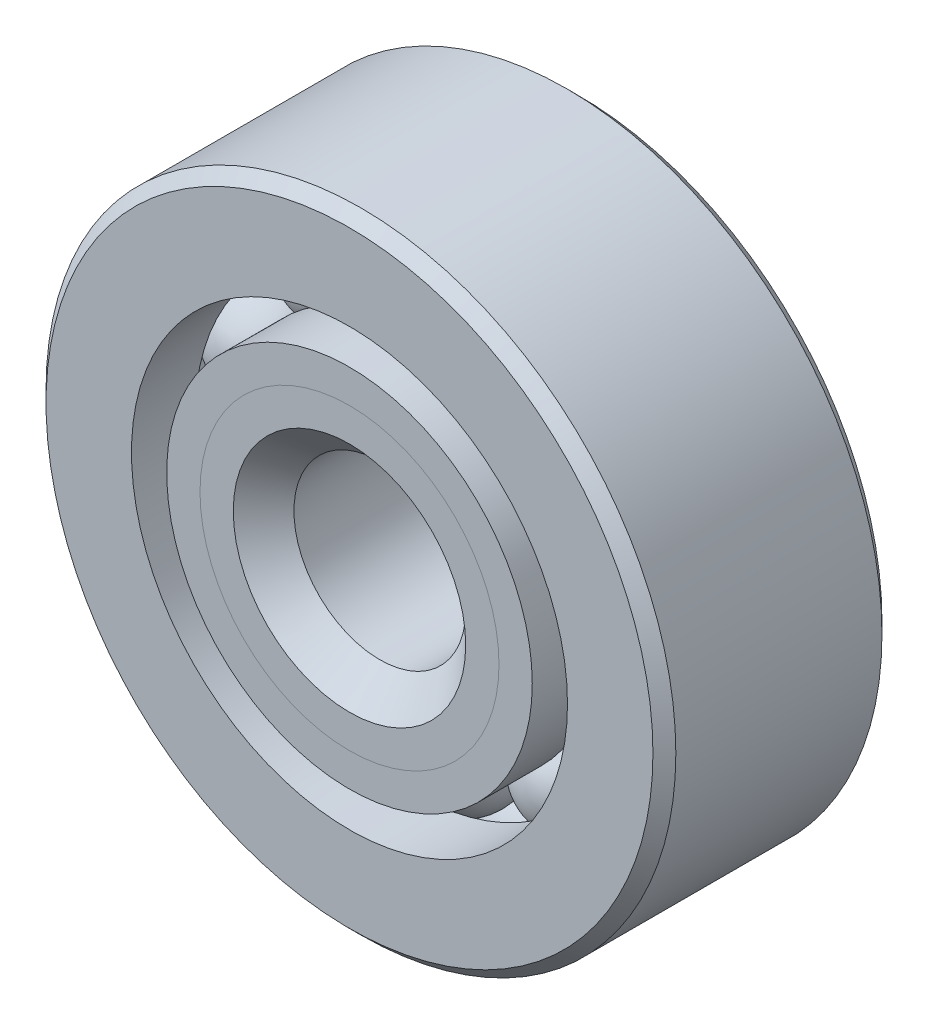
ISO-10303-21;
HEADER;
FILE_DESCRIPTION(('STEP AP214'),'2;1');
FILE_NAME('part.step','',(''),(''),'','','');
FILE_SCHEMA(('AUTOMOTIVE_DESIGN { 1 0 10303 214 1 1 1 1 }'));
ENDSEC;
DATA;
#1=APPLICATION_CONTEXT('core data for automotive mechanical design processes');
#2=APPLICATION_PROTOCOL_DEFINITION('international standard','automotive_design',2000,#1);
#3=PRODUCT_CONTEXT('',#1,'mechanical');
#4=PRODUCT('Part','Part','',(#3));
#5=PRODUCT_RELATED_PRODUCT_CATEGORY('part','',(#4));
#6=PRODUCT_DEFINITION_FORMATION('','',#4);
#7=PRODUCT_DEFINITION_CONTEXT('part definition',#1,'design');
#8=PRODUCT_DEFINITION('design','',#6,#7);
#9=PRODUCT_DEFINITION_SHAPE('','',#8);
#10=(LENGTH_UNIT() NAMED_UNIT(*) SI_UNIT(.MILLI.,.METRE.));
#11=(NAMED_UNIT(*) PLANE_ANGLE_UNIT() SI_UNIT($,.RADIAN.));
#12=(NAMED_UNIT(*) SI_UNIT($,.STERADIAN.) SOLID_ANGLE_UNIT());
#13=UNCERTAINTY_MEASURE_WITH_UNIT(LENGTH_MEASURE(1.E-05),#10,'distance_accuracy_value','');
#14=(GEOMETRIC_REPRESENTATION_CONTEXT(3) GLOBAL_UNCERTAINTY_ASSIGNED_CONTEXT((#13)) GLOBAL_UNIT_ASSIGNED_CONTEXT((#10,
#11,#12)) REPRESENTATION_CONTEXT('',''));
#15=CARTESIAN_POINT('',(0.,0.,0.));
#16=DIRECTION('',(0.,0.,1.));
#17=DIRECTION('',(1.,0.,0.));
#18=AXIS2_PLACEMENT_3D('',#15,#16,#17);
#19=CARTESIAN_POINT('',(-3.26588180804999,4.49510067499584,0.));
#20=DIRECTION('',(0.,0.,1.));
#21=DIRECTION('',(-0.587785252292462,0.809016994374955,0.));
#22=AXIS2_PLACEMENT_3D('',#19,#20,#21);
#23=SPHERICAL_SURFACE('',#22,1.4932612773582);
#24=CARTESIAN_POINT('',(-3.26588180804999,4.49510067499584,1.4932612773582));
#25=VERTEX_POINT('',#24);
#26=VERTEX_LOOP('',#25);
#27=FACE_BOUND('',#26,.T.);
#28=ADVANCED_FACE('F43',(#27),#23,.T.);
#29=CLOSED_SHELL('',(#28));
#30=MANIFOLD_SOLID_BREP('B2',#29);
#31=CARTESIAN_POINT('',(-5.28430776866493,1.71697567499586,0.));
#32=DIRECTION('',(0.,0.,1.));
#33=DIRECTION('',(-0.95105651629515,0.309016994374958,0.));
#34=AXIS2_PLACEMENT_3D('',#31,#32,#33);
#35=SPHERICAL_SURFACE('',#34,1.4932612773582);
#36=CARTESIAN_POINT('',(-5.28430776866493,1.71697567499586,1.4932612773582));
#37=VERTEX_POINT('',#36);
#38=VERTEX_LOOP('',#37);
#39=FACE_BOUND('',#38,.T.);
#40=ADVANCED_FACE('F64',(#39),#35,.T.);
#41=CLOSED_SHELL('',(#40));
#42=MANIFOLD_SOLID_BREP('B6',#41);
#43=CARTESIAN_POINT('',(-5.28430776866496,-1.71697567499575,0.));
#44=DIRECTION('',(0.,0.,1.));
#45=DIRECTION('',(-0.951056516295157,-0.309016994374938,0.));
#46=AXIS2_PLACEMENT_3D('',#43,#44,#45);
#47=SPHERICAL_SURFACE('',#46,1.4932612773582);
#48=CARTESIAN_POINT('',(-5.28430776866496,-1.71697567499575,1.4932612773582));
#49=VERTEX_POINT('',#48);
#50=VERTEX_LOOP('',#49);
#51=FACE_BOUND('',#50,.T.);
#52=ADVANCED_FACE('F85',(#51),#47,.T.);
#53=CLOSED_SHELL('',(#52));
#54=MANIFOLD_SOLID_BREP('B39',#53);
#55=CARTESIAN_POINT('',(-3.26588180805009,-4.49510067499577,0.));
#56=DIRECTION('',(0.,0.,1.));
#57=DIRECTION('',(-0.58778525229248,-0.809016994374942,0.));
#58=AXIS2_PLACEMENT_3D('',#55,#56,#57);
#59=SPHERICAL_SURFACE('',#58,1.4932612773582);
#60=CARTESIAN_POINT('',(-3.26588180805009,-4.49510067499577,1.4932612773582));
#61=VERTEX_POINT('',#60);
#62=VERTEX_LOOP('',#61);
#63=FACE_BOUND('',#62,.T.);
#64=ADVANCED_FACE('F106',(#63),#59,.T.);
#65=CLOSED_SHELL('',(#64));
#66=MANIFOLD_SOLID_BREP('B60',#65);
#67=CARTESIAN_POINT('',(0.,-5.55625,0.));
#68=DIRECTION('',(0.,0.,1.));
#69=DIRECTION('',(0.,-1.,0.));
#70=AXIS2_PLACEMENT_3D('',#67,#68,#69);
#71=SPHERICAL_SURFACE('',#70,1.4932612773582);
#72=CARTESIAN_POINT('',(0.,-5.55625,1.4932612773582));
#73=VERTEX_POINT('',#72);
#74=VERTEX_LOOP('',#73);
#75=FACE_BOUND('',#74,.T.);
#76=ADVANCED_FACE('F127',(#75),#71,.T.);
#77=CLOSED_SHELL('',(#76));
#78=MANIFOLD_SOLID_BREP('B81',#77);
#79=CARTESIAN_POINT('',(3.26588180805003,-4.49510067499582,0.));
#80=DIRECTION('',(0.,0.,1.));
#81=DIRECTION('',(0.587785252292469,-0.809016994374951,0.));
#82=AXIS2_PLACEMENT_3D('',#79,#80,#81);
#83=SPHERICAL_SURFACE('',#82,1.4932612773582);
#84=CARTESIAN_POINT('',(3.26588180805003,-4.49510067499582,1.4932612773582));
#85=VERTEX_POINT('',#84);
#86=VERTEX_LOOP('',#85);
#87=FACE_BOUND('',#86,.T.);
#88=ADVANCED_FACE('F148',(#87),#83,.T.);
#89=CLOSED_SHELL('',(#88));
#90=MANIFOLD_SOLID_BREP('B102',#89);
#91=CARTESIAN_POINT('',(5.28430776866494,-1.71697567499582,0.));
#92=DIRECTION('',(0.,0.,1.));
#93=DIRECTION('',(0.951056516295152,-0.309016994374952,0.));
#94=AXIS2_PLACEMENT_3D('',#91,#92,#93);
#95=SPHERICAL_SURFACE('',#94,1.4932612773582);
#96=CARTESIAN_POINT('',(5.28430776866494,-1.71697567499582,1.4932612773582));
#97=VERTEX_POINT('',#96);
#98=VERTEX_LOOP('',#97);
#99=FACE_BOUND('',#98,.T.);
#100=ADVANCED_FACE('F169',(#99),#95,.T.);
#101=CLOSED_SHELL('',(#100));
#102=MANIFOLD_SOLID_BREP('B123',#101);
#103=CARTESIAN_POINT('',(5.28430776866495,1.71697567499579,0.));
#104=DIRECTION('',(0.,0.,1.));
#105=DIRECTION('',(0.951056516295155,0.309016994374945,0.));
#106=AXIS2_PLACEMENT_3D('',#103,#104,#105);
#107=SPHERICAL_SURFACE('',#106,1.4932612773582);
#108=CARTESIAN_POINT('',(5.28430776866495,1.71697567499579,1.4932612773582));
#109=VERTEX_POINT('',#108);
#110=VERTEX_LOOP('',#109);
#111=FACE_BOUND('',#110,.T.);
#112=ADVANCED_FACE('F190',(#111),#107,.T.);
#113=CLOSED_SHELL('',(#112));
#114=MANIFOLD_SOLID_BREP('B144',#113);
#115=CARTESIAN_POINT('',(3.26588180805006,4.4951006749958,0.));
#116=DIRECTION('',(0.,0.,1.));
#117=DIRECTION('',(0.587785252292474,0.809016994374947,0.));
#118=AXIS2_PLACEMENT_3D('',#115,#116,#117);
#119=SPHERICAL_SURFACE('',#118,1.4932612773582);
#120=CARTESIAN_POINT('',(3.26588180805006,4.4951006749958,1.4932612773582));
#121=VERTEX_POINT('',#120);
#122=VERTEX_LOOP('',#121);
#123=FACE_BOUND('',#122,.T.);
#124=ADVANCED_FACE('F211',(#123),#119,.T.);
#125=CLOSED_SHELL('',(#124));
#126=MANIFOLD_SOLID_BREP('B165',#125);
#127=CARTESIAN_POINT('',(0.,5.55625,0.));
#128=DIRECTION('',(0.,0.,1.));
#129=DIRECTION('',(0.,1.,0.));
#130=AXIS2_PLACEMENT_3D('',#127,#128,#129);
#131=SPHERICAL_SURFACE('',#130,1.4932612773582);
#132=CARTESIAN_POINT('',(0.,5.55625,1.4932612773582));
#133=VERTEX_POINT('',#132);
#134=VERTEX_LOOP('',#133);
#135=FACE_BOUND('',#134,.T.);
#136=ADVANCED_FACE('F233',(#135),#131,.T.);
#137=CLOSED_SHELL('',(#136));
#138=MANIFOLD_SOLID_BREP('B186',#137);
#139=CARTESIAN_POINT('',(0.,4.14495391142968,3.175));
#140=DIRECTION('',(0.,0.,-1.));
#141=DIRECTION('',(-1.,0.,0.));
#142=AXIS2_PLACEMENT_3D('',#139,#140,#141);
#143=PLANE('',#142);
#144=CARTESIAN_POINT('',(0.,0.,3.175));
#145=DIRECTION('',(0.,0.,1.));
#146=DIRECTION('',(1.,0.,0.));
#147=AXIS2_PLACEMENT_3D('',#144,#145,#146);
#148=CIRCLE('',#147,3.2221193613209);
#149=CARTESIAN_POINT('',(3.2221193613209,0.,3.175));
#150=VERTEX_POINT('',#149);
#151=EDGE_CURVE('E288',#150,#150,#148,.T.);
#152=ORIENTED_EDGE('',*,*,#151,.F.);
#153=EDGE_LOOP('',(#152));
#154=FACE_BOUND('',#153,.T.);
#155=CARTESIAN_POINT('',(0.,0.,3.175));
#156=DIRECTION('',(0.,0.,1.));
#157=DIRECTION('',(1.,0.,0.));
#158=AXIS2_PLACEMENT_3D('',#155,#156,#157);
#159=CIRCLE('',#158,4.14495391142968);
#160=CARTESIAN_POINT('',(4.14495391142968,0.,3.175));
#161=VERTEX_POINT('',#160);
#162=EDGE_CURVE('E232',#161,#161,#159,.T.);
#163=ORIENTED_EDGE('',*,*,#162,.T.);
#164=EDGE_LOOP('',(#163));
#165=FACE_BOUND('',#164,.T.);
#166=ADVANCED_FACE('F254',(#154,#165),#143,.F.);
#167=CARTESIAN_POINT('',(0.,0.,2.25216544989122));
#168=DIRECTION('',(0.,0.,1.));
#169=DIRECTION('',(1.,0.,0.));
#170=AXIS2_PLACEMENT_3D('',#167,#168,#169);
#171=CONICAL_SURFACE('',#170,3.2221193613209,0.785398163397452);
#172=ORIENTED_EDGE('',*,*,#162,.F.);
#173=EDGE_LOOP('',(#172));
#174=FACE_BOUND('',#173,.T.);
#175=CARTESIAN_POINT('',(0.,0.,2.25216544989122));
#176=DIRECTION('',(0.,0.,1.));
#177=DIRECTION('',(1.,0.,0.));
#178=AXIS2_PLACEMENT_3D('',#175,#176,#177);
#179=CIRCLE('',#178,3.2221193613209);
#180=CARTESIAN_POINT('',(3.2221193613209,0.,2.25216544989122));
#181=VERTEX_POINT('',#180);
#182=EDGE_CURVE('E260',#181,#181,#179,.T.);
#183=ORIENTED_EDGE('',*,*,#182,.T.);
#184=EDGE_LOOP('',(#183));
#185=FACE_BOUND('',#184,.T.);
#186=ADVANCED_FACE('F295',(#174,#185),#171,.T.);
#187=CARTESIAN_POINT('',(0.,0.,3.175));
#188=DIRECTION('',(0.,0.,1.));
#189=DIRECTION('',(1.,0.,0.));
#190=AXIS2_PLACEMENT_3D('',#187,#188,#189);
#191=CYLINDRICAL_SURFACE('',#190,3.2221193613209);
#192=ORIENTED_EDGE('',*,*,#182,.F.);
#193=EDGE_LOOP('',(#192));
#194=FACE_BOUND('',#193,.T.);
#195=CARTESIAN_POINT('',(0.,0.,0.));
#196=DIRECTION('',(0.,0.,1.));
#197=DIRECTION('',(1.,0.,0.));
#198=AXIS2_PLACEMENT_3D('',#195,#196,#197);
#199=CIRCLE('',#198,3.2221193613209);
#200=CARTESIAN_POINT('',(3.2221193613209,0.,0.));
#201=VERTEX_POINT('',#200);
#202=EDGE_CURVE('E264',#201,#201,#199,.T.);
#203=ORIENTED_EDGE('',*,*,#202,.T.);
#204=EDGE_LOOP('',(#203));
#205=FACE_BOUND('',#204,.T.);
#206=ADVANCED_FACE('F299',(#194,#205),#191,.T.);
#207=CARTESIAN_POINT('',(0.,3.2221193613209,0.));
#208=DIRECTION('',(0.,0.,-1.));
#209=DIRECTION('',(-1.,0.,0.));
#210=AXIS2_PLACEMENT_3D('',#207,#208,#209);
#211=PLANE('',#210);
#212=ORIENTED_EDGE('',*,*,#202,.F.);
#213=EDGE_LOOP('',(#212));
#214=FACE_BOUND('',#213,.T.);
#215=CARTESIAN_POINT('',(0.,0.,0.));
#216=DIRECTION('',(0.,0.,1.));
#217=DIRECTION('',(1.,0.,0.));
#218=AXIS2_PLACEMENT_3D('',#215,#216,#217);
#219=CIRCLE('',#218,4.0629887226418);
#220=CARTESIAN_POINT('',(4.0629887226418,0.,0.));
#221=VERTEX_POINT('',#220);
#222=EDGE_CURVE('E268',#221,#221,#219,.T.);
#223=ORIENTED_EDGE('',*,*,#222,.T.);
#224=EDGE_LOOP('',(#223));
#225=FACE_BOUND('',#224,.T.);
#226=ADVANCED_FACE('F304',(#214,#225),#211,.F.);
#227=CARTESIAN_POINT('',(0.,0.,0.));
#228=DIRECTION('',(0.,0.,1.));
#229=DIRECTION('',(1.,0.,0.));
#230=AXIS2_PLACEMENT_3D('',#227,#228,#229);
#231=TOROIDAL_SURFACE('',#230,5.55625,1.4932612773582);
#232=ORIENTED_EDGE('',*,*,#222,.F.);
#233=EDGE_LOOP('',(#232));
#234=FACE_BOUND('',#233,.T.);
#235=CARTESIAN_POINT('',(0.,0.,-1.41111111111111));
#236=DIRECTION('',(0.,0.,1.));
#237=DIRECTION('',(1.,0.,0.));
#238=AXIS2_PLACEMENT_3D('',#235,#236,#237);
#239=CIRCLE('',#238,5.06778846153846);
#240=CARTESIAN_POINT('',(5.06778846153846,0.,-1.41111111111111));
#241=VERTEX_POINT('',#240);
#242=EDGE_CURVE('E273',#241,#241,#239,.T.);
#243=ORIENTED_EDGE('',*,*,#242,.T.);
#244=EDGE_LOOP('',(#243));
#245=FACE_BOUND('',#244,.T.);
#246=ADVANCED_FACE('F310',(#234,#245),#231,.F.);
#247=CARTESIAN_POINT('',(0.,0.,3.175));
#248=DIRECTION('',(0.,0.,1.));
#249=DIRECTION('',(1.,0.,0.));
#250=AXIS2_PLACEMENT_3D('',#247,#248,#249);
#251=CYLINDRICAL_SURFACE('',#250,5.06778846153846);
#252=ORIENTED_EDGE('',*,*,#242,.F.);
#253=EDGE_LOOP('',(#252));
#254=FACE_BOUND('',#253,.T.);
#255=CARTESIAN_POINT('',(0.,0.,-3.17500000000001));
#256=DIRECTION('',(0.,0.,1.));
#257=DIRECTION('',(1.,0.,0.));
#258=AXIS2_PLACEMENT_3D('',#255,#256,#257);
#259=CIRCLE('',#258,5.06778846153846);
#260=CARTESIAN_POINT('',(5.06778846153846,0.,-3.17500000000001));
#261=VERTEX_POINT('',#260);
#262=EDGE_CURVE('E276',#261,#261,#259,.T.);
#263=ORIENTED_EDGE('',*,*,#262,.T.);
#264=EDGE_LOOP('',(#263));
#265=FACE_BOUND('',#264,.T.);
#266=ADVANCED_FACE('F314',(#254,#265),#251,.T.);
#267=CARTESIAN_POINT('',(0.,2.69875,-3.17500000000001));
#268=DIRECTION('',(0.,0.,1.));
#269=DIRECTION('',(1.,0.,0.));
#270=AXIS2_PLACEMENT_3D('',#267,#268,#269);
#271=PLANE('',#270);
#272=ORIENTED_EDGE('',*,*,#262,.F.);
#273=EDGE_LOOP('',(#272));
#274=FACE_BOUND('',#273,.T.);
#275=CARTESIAN_POINT('',(0.,0.,-3.17500000000001));
#276=DIRECTION('',(0.,0.,1.));
#277=DIRECTION('',(1.,0.,0.));
#278=AXIS2_PLACEMENT_3D('',#275,#276,#277);
#279=CIRCLE('',#278,2.69875);
#280=CARTESIAN_POINT('',(2.69875,0.,-3.17500000000001));
#281=VERTEX_POINT('',#280);
#282=EDGE_CURVE('E279',#281,#281,#279,.T.);
#283=ORIENTED_EDGE('',*,*,#282,.T.);
#284=EDGE_LOOP('',(#283));
#285=FACE_BOUND('',#284,.T.);
#286=ADVANCED_FACE('F318',(#274,#285),#271,.F.);
#287=CARTESIAN_POINT('',(0.,0.,-2.8575));
#288=DIRECTION('',(0.,0.,-1.));
#289=DIRECTION('',(-1.,0.,0.));
#290=AXIS2_PLACEMENT_3D('',#287,#288,#289);
#291=CONICAL_SURFACE('',#290,2.38125,0.785398163397451);
#292=ORIENTED_EDGE('',*,*,#282,.F.);
#293=EDGE_LOOP('',(#292));
#294=FACE_BOUND('',#293,.T.);
#295=CARTESIAN_POINT('',(0.,0.,-2.8575));
#296=DIRECTION('',(0.,0.,1.));
#297=DIRECTION('',(1.,0.,0.));
#298=AXIS2_PLACEMENT_3D('',#295,#296,#297);
#299=CIRCLE('',#298,2.38125);
#300=CARTESIAN_POINT('',(2.38125,0.,-2.8575));
#301=VERTEX_POINT('',#300);
#302=EDGE_CURVE('E282',#301,#301,#299,.T.);
#303=ORIENTED_EDGE('',*,*,#302,.T.);
#304=EDGE_LOOP('',(#303));
#305=FACE_BOUND('',#304,.T.);
#306=ADVANCED_FACE('F322',(#294,#305),#291,.F.);
#307=CARTESIAN_POINT('',(0.,0.,3.175));
#308=DIRECTION('',(0.,0.,1.));
#309=DIRECTION('',(1.,0.,0.));
#310=AXIS2_PLACEMENT_3D('',#307,#308,#309);
#311=CYLINDRICAL_SURFACE('',#310,2.38125);
#312=ORIENTED_EDGE('',*,*,#302,.F.);
#313=EDGE_LOOP('',(#312));
#314=FACE_BOUND('',#313,.T.);
#315=CARTESIAN_POINT('',(0.,0.,2.33413063867911));
#316=DIRECTION('',(0.,0.,1.));
#317=DIRECTION('',(1.,0.,0.));
#318=AXIS2_PLACEMENT_3D('',#315,#316,#317);
#319=CIRCLE('',#318,2.38125);
#320=CARTESIAN_POINT('',(2.38125,0.,2.33413063867911));
#321=VERTEX_POINT('',#320);
#322=EDGE_CURVE('E285',#321,#321,#319,.T.);
#323=ORIENTED_EDGE('',*,*,#322,.T.);
#324=EDGE_LOOP('',(#323));
#325=FACE_BOUND('',#324,.T.);
#326=ADVANCED_FACE('F326',(#314,#325),#311,.F.);
#327=CARTESIAN_POINT('',(0.,0.,3.175));
#328=DIRECTION('',(0.,0.,1.));
#329=DIRECTION('',(1.,0.,0.));
#330=AXIS2_PLACEMENT_3D('',#327,#328,#329);
#331=CONICAL_SURFACE('',#330,3.2221193613209,0.785398163397451);
#332=ORIENTED_EDGE('',*,*,#322,.F.);
#333=EDGE_LOOP('',(#332));
#334=FACE_BOUND('',#333,.T.);
#335=ORIENTED_EDGE('',*,*,#151,.T.);
#336=EDGE_LOOP('',(#335));
#337=FACE_BOUND('',#336,.T.);
#338=ADVANCED_FACE('F292',(#334,#337),#331,.F.);
#339=CLOSED_SHELL('',(#166,#186,#206,#226,#246,#266,#286,#306,#326,#338));
#340=MANIFOLD_SOLID_BREP('B207',#339);
#341=CARTESIAN_POINT('',(0.,5.06778846153846,3.175));
#342=DIRECTION('',(0.,0.,-1.));
#343=DIRECTION('',(-1.,0.,0.));
#344=AXIS2_PLACEMENT_3D('',#341,#342,#343);
#345=PLANE('',#344);
#346=CARTESIAN_POINT('',(0.,0.,3.175));
#347=DIRECTION('',(0.,0.,1.));
#348=DIRECTION('',(1.,0.,0.));
#349=AXIS2_PLACEMENT_3D('',#346,#347,#348);
#350=CIRCLE('',#349,4.14495391142968);
#351=CARTESIAN_POINT('',(4.14495391142968,0.,3.175));
#352=VERTEX_POINT('',#351);
#353=EDGE_CURVE('E253',#352,#352,#350,.T.);
#354=ORIENTED_EDGE('',*,*,#353,.F.);
#355=EDGE_LOOP('',(#354));
#356=FACE_BOUND('',#355,.T.);
#357=CARTESIAN_POINT('',(0.,0.,3.175));
#358=DIRECTION('',(0.,0.,1.));
#359=DIRECTION('',(1.,0.,0.));
#360=AXIS2_PLACEMENT_3D('',#357,#358,#359);
#361=CIRCLE('',#360,5.06778846153846);
#362=CARTESIAN_POINT('',(5.06778846153846,0.,3.175));
#363=VERTEX_POINT('',#362);
#364=EDGE_CURVE('E435',#363,#363,#361,.T.);
#365=ORIENTED_EDGE('',*,*,#364,.T.);
#366=EDGE_LOOP('',(#365));
#367=FACE_BOUND('',#366,.T.);
#368=ADVANCED_FACE('F413',(#356,#367),#345,.F.);
#369=CARTESIAN_POINT('',(0.,0.,3.175));
#370=DIRECTION('',(0.,0.,1.));
#371=DIRECTION('',(1.,0.,0.));
#372=AXIS2_PLACEMENT_3D('',#369,#370,#371);
#373=CONICAL_SURFACE('',#372,4.14495391142968,0.785398163397452);
#374=CARTESIAN_POINT('',(0.,0.,2.25216544989122));
#375=DIRECTION('',(0.,0.,1.));
#376=DIRECTION('',(1.,0.,0.));
#377=AXIS2_PLACEMENT_3D('',#374,#375,#376);
#378=CIRCLE('',#377,3.2221193613209);
#379=CARTESIAN_POINT('',(3.2221193613209,0.,2.25216544989122));
#380=VERTEX_POINT('',#379);
#381=EDGE_CURVE('E419',#380,#380,#378,.T.);
#382=ORIENTED_EDGE('',*,*,#381,.F.);
#383=EDGE_LOOP('',(#382));
#384=FACE_BOUND('',#383,.T.);
#385=ORIENTED_EDGE('',*,*,#353,.T.);
#386=EDGE_LOOP('',(#385));
#387=FACE_BOUND('',#386,.T.);
#388=ADVANCED_FACE('F460',(#384,#387),#373,.F.);
#389=CARTESIAN_POINT('',(0.,0.,3.175));
#390=DIRECTION('',(0.,0.,1.));
#391=DIRECTION('',(1.,0.,0.));
#392=AXIS2_PLACEMENT_3D('',#389,#390,#391);
#393=CYLINDRICAL_SURFACE('',#392,3.2221193613209);
#394=CARTESIAN_POINT('',(0.,0.,0.));
#395=DIRECTION('',(0.,0.,1.));
#396=DIRECTION('',(1.,0.,0.));
#397=AXIS2_PLACEMENT_3D('',#394,#395,#396);
#398=CIRCLE('',#397,3.2221193613209);
#399=CARTESIAN_POINT('',(3.2221193613209,0.,0.));
#400=VERTEX_POINT('',#399);
#401=EDGE_CURVE('E423',#400,#400,#398,.T.);
#402=ORIENTED_EDGE('',*,*,#401,.F.);
#403=EDGE_LOOP('',(#402));
#404=FACE_BOUND('',#403,.T.);
#405=ORIENTED_EDGE('',*,*,#381,.T.);
#406=EDGE_LOOP('',(#405));
#407=FACE_BOUND('',#406,.T.);
#408=ADVANCED_FACE('F455',(#404,#407),#393,.F.);
#409=CARTESIAN_POINT('',(0.,3.2221193613209,0.));
#410=DIRECTION('',(0.,0.,1.));
#411=DIRECTION('',(1.,0.,0.));
#412=AXIS2_PLACEMENT_3D('',#409,#410,#411);
#413=PLANE('',#412);
#414=CARTESIAN_POINT('',(0.,0.,0.));
#415=DIRECTION('',(0.,0.,1.));
#416=DIRECTION('',(1.,0.,0.));
#417=AXIS2_PLACEMENT_3D('',#414,#415,#416);
#418=CIRCLE('',#417,4.0629887226418);
#419=CARTESIAN_POINT('',(4.0629887226418,0.,0.));
#420=VERTEX_POINT('',#419);
#421=EDGE_CURVE('E427',#420,#420,#418,.T.);
#422=ORIENTED_EDGE('',*,*,#421,.F.);
#423=EDGE_LOOP('',(#422));
#424=FACE_BOUND('',#423,.T.);
#425=ORIENTED_EDGE('',*,*,#401,.T.);
#426=EDGE_LOOP('',(#425));
#427=FACE_BOUND('',#426,.T.);
#428=ADVANCED_FACE('F449',(#424,#427),#413,.F.);
#429=CARTESIAN_POINT('',(0.,0.,0.));
#430=DIRECTION('',(0.,0.,1.));
#431=DIRECTION('',(1.,0.,0.));
#432=AXIS2_PLACEMENT_3D('',#429,#430,#431);
#433=TOROIDAL_SURFACE('',#432,5.55625,1.4932612773582);
#434=CARTESIAN_POINT('',(0.,0.,1.41111111111111));
#435=DIRECTION('',(0.,0.,1.));
#436=DIRECTION('',(1.,0.,0.));
#437=AXIS2_PLACEMENT_3D('',#434,#435,#436);
#438=CIRCLE('',#437,5.06778846153846);
#439=CARTESIAN_POINT('',(5.06778846153846,0.,1.41111111111111));
#440=VERTEX_POINT('',#439);
#441=EDGE_CURVE('E432',#440,#440,#438,.T.);
#442=ORIENTED_EDGE('',*,*,#441,.F.);
#443=EDGE_LOOP('',(#442));
#444=FACE_BOUND('',#443,.T.);
#445=ORIENTED_EDGE('',*,*,#421,.T.);
#446=EDGE_LOOP('',(#445));
#447=FACE_BOUND('',#446,.T.);
#448=ADVANCED_FACE('F443',(#444,#447),#433,.F.);
#449=CARTESIAN_POINT('',(0.,0.,3.175));
#450=DIRECTION('',(0.,0.,1.));
#451=DIRECTION('',(1.,0.,0.));
#452=AXIS2_PLACEMENT_3D('',#449,#450,#451);
#453=CYLINDRICAL_SURFACE('',#452,5.06778846153846);
#454=ORIENTED_EDGE('',*,*,#364,.F.);
#455=EDGE_LOOP('',(#454));
#456=FACE_BOUND('',#455,.T.);
#457=ORIENTED_EDGE('',*,*,#441,.T.);
#458=EDGE_LOOP('',(#457));
#459=FACE_BOUND('',#458,.T.);
#460=ADVANCED_FACE('F440',(#456,#459),#453,.T.);
#461=CLOSED_SHELL('',(#368,#388,#408,#428,#448,#460));
#462=MANIFOLD_SOLID_BREP('B227',#461);
#463=CARTESIAN_POINT('',(0.,0.,2.8575));
#464=DIRECTION('',(0.,0.,-1.));
#465=DIRECTION('',(-1.,0.,0.));
#466=AXIS2_PLACEMENT_3D('',#463,#464,#465);
#467=CONICAL_SURFACE('',#466,8.73125,0.785398163397452);
#468=CARTESIAN_POINT('',(0.,0.,3.175));
#469=DIRECTION('',(0.,0.,1.));
#470=DIRECTION('',(1.,0.,0.));
#471=AXIS2_PLACEMENT_3D('',#468,#469,#470);
#472=CIRCLE('',#471,8.41375);
#473=CARTESIAN_POINT('',(8.41375,0.,3.175));
#474=VERTEX_POINT('',#473);
#475=EDGE_CURVE('E533',#474,#474,#472,.T.);
#476=ORIENTED_EDGE('',*,*,#475,.F.);
#477=EDGE_LOOP('',(#476));
#478=FACE_BOUND('',#477,.T.);
#479=CARTESIAN_POINT('',(0.,0.,2.8575));
#480=DIRECTION('',(0.,0.,1.));
#481=DIRECTION('',(1.,0.,0.));
#482=AXIS2_PLACEMENT_3D('',#479,#480,#481);
#483=CIRCLE('',#482,8.73125);
#484=CARTESIAN_POINT('',(8.73125,0.,2.8575));
#485=VERTEX_POINT('',#484);
#486=EDGE_CURVE('E412',#485,#485,#483,.T.);
#487=ORIENTED_EDGE('',*,*,#486,.T.);
#488=EDGE_LOOP('',(#487));
#489=FACE_BOUND('',#488,.T.);
#490=ADVANCED_FACE('F505',(#478,#489),#467,.T.);
#491=CARTESIAN_POINT('',(0.,0.,3.175));
#492=DIRECTION('',(0.,0.,1.));
#493=DIRECTION('',(1.,0.,0.));
#494=AXIS2_PLACEMENT_3D('',#491,#492,#493);
#495=CYLINDRICAL_SURFACE('',#494,8.73125);
#496=ORIENTED_EDGE('',*,*,#486,.F.);
#497=EDGE_LOOP('',(#496));
#498=FACE_BOUND('',#497,.T.);
#499=CARTESIAN_POINT('',(0.,0.,-2.8575));
#500=DIRECTION('',(0.,0.,1.));
#501=DIRECTION('',(1.,0.,0.));
#502=AXIS2_PLACEMENT_3D('',#499,#500,#501);
#503=CIRCLE('',#502,8.73125);
#504=CARTESIAN_POINT('',(8.73125,0.,-2.8575));
#505=VERTEX_POINT('',#504);
#506=EDGE_CURVE('E511',#505,#505,#503,.T.);
#507=ORIENTED_EDGE('',*,*,#506,.T.);
#508=EDGE_LOOP('',(#507));
#509=FACE_BOUND('',#508,.T.);
#510=ADVANCED_FACE('F540',(#498,#509),#495,.T.);
#511=CARTESIAN_POINT('',(0.,0.,-3.17500000000001));
#512=DIRECTION('',(0.,0.,1.));
#513=DIRECTION('',(1.,0.,0.));
#514=AXIS2_PLACEMENT_3D('',#511,#512,#513);
#515=CONICAL_SURFACE('',#514,8.41375,0.785398163397451);
#516=ORIENTED_EDGE('',*,*,#506,.F.);
#517=EDGE_LOOP('',(#516));
#518=FACE_BOUND('',#517,.T.);
#519=CARTESIAN_POINT('',(0.,0.,-3.17500000000001));
#520=DIRECTION('',(0.,0.,1.));
#521=DIRECTION('',(1.,0.,0.));
#522=AXIS2_PLACEMENT_3D('',#519,#520,#521);
#523=CIRCLE('',#522,8.41375);
#524=CARTESIAN_POINT('',(8.41375,0.,-3.17500000000001));
#525=VERTEX_POINT('',#524);
#526=EDGE_CURVE('E515',#525,#525,#523,.T.);
#527=ORIENTED_EDGE('',*,*,#526,.T.);
#528=EDGE_LOOP('',(#527));
#529=FACE_BOUND('',#528,.T.);
#530=ADVANCED_FACE('F544',(#518,#529),#515,.T.);
#531=CARTESIAN_POINT('',(0.,8.41375,-3.17500000000001));
#532=DIRECTION('',(0.,0.,1.));
#533=DIRECTION('',(1.,0.,0.));
#534=AXIS2_PLACEMENT_3D('',#531,#532,#533);
#535=PLANE('',#534);
#536=ORIENTED_EDGE('',*,*,#526,.F.);
#537=EDGE_LOOP('',(#536));
#538=FACE_BOUND('',#537,.T.);
#539=CARTESIAN_POINT('',(0.,0.,-3.17500000000001));
#540=DIRECTION('',(0.,0.,1.));
#541=DIRECTION('',(1.,0.,0.));
#542=AXIS2_PLACEMENT_3D('',#539,#540,#541);
#543=CIRCLE('',#542,6.04471153846154);
#544=CARTESIAN_POINT('',(6.04471153846154,0.,-3.17500000000001));
#545=VERTEX_POINT('',#544);
#546=EDGE_CURVE('E519',#545,#545,#543,.T.);
#547=ORIENTED_EDGE('',*,*,#546,.T.);
#548=EDGE_LOOP('',(#547));
#549=FACE_BOUND('',#548,.T.);
#550=ADVANCED_FACE('F549',(#538,#549),#535,.F.);
#551=CARTESIAN_POINT('',(0.,0.,3.175));
#552=DIRECTION('',(0.,0.,1.));
#553=DIRECTION('',(1.,0.,0.));
#554=AXIS2_PLACEMENT_3D('',#551,#552,#553);
#555=CYLINDRICAL_SURFACE('',#554,6.04471153846154);
#556=ORIENTED_EDGE('',*,*,#546,.F.);
#557=EDGE_LOOP('',(#556));
#558=FACE_BOUND('',#557,.T.);
#559=CARTESIAN_POINT('',(0.,0.,-1.41111111111111));
#560=DIRECTION('',(0.,0.,1.));
#561=DIRECTION('',(1.,0.,0.));
#562=AXIS2_PLACEMENT_3D('',#559,#560,#561);
#563=CIRCLE('',#562,6.04471153846153);
#564=CARTESIAN_POINT('',(6.04471153846153,0.,-1.41111111111111));
#565=VERTEX_POINT('',#564);
#566=EDGE_CURVE('E524',#565,#565,#563,.T.);
#567=ORIENTED_EDGE('',*,*,#566,.T.);
#568=EDGE_LOOP('',(#567));
#569=FACE_BOUND('',#568,.T.);
#570=ADVANCED_FACE('F555',(#558,#569),#555,.F.);
#571=CARTESIAN_POINT('',(0.,0.,0.));
#572=DIRECTION('',(0.,0.,1.));
#573=DIRECTION('',(1.,0.,0.));
#574=AXIS2_PLACEMENT_3D('',#571,#572,#573);
#575=TOROIDAL_SURFACE('',#574,5.55625,1.4932612773582);
#576=ORIENTED_EDGE('',*,*,#566,.F.);
#577=EDGE_LOOP('',(#576));
#578=FACE_BOUND('',#577,.T.);
#579=CARTESIAN_POINT('',(0.,0.,1.41111111111111));
#580=DIRECTION('',(0.,0.,1.));
#581=DIRECTION('',(1.,0.,0.));
#582=AXIS2_PLACEMENT_3D('',#579,#580,#581);
#583=CIRCLE('',#582,6.04471153846153);
#584=CARTESIAN_POINT('',(6.04471153846153,0.,1.41111111111111));
#585=VERTEX_POINT('',#584);
#586=EDGE_CURVE('E527',#585,#585,#583,.T.);
#587=ORIENTED_EDGE('',*,*,#586,.T.);
#588=EDGE_LOOP('',(#587));
#589=FACE_BOUND('',#588,.T.);
#590=ADVANCED_FACE('F559',(#578,#589),#575,.F.);
#591=CARTESIAN_POINT('',(0.,0.,3.175));
#592=DIRECTION('',(0.,0.,1.));
#593=DIRECTION('',(1.,0.,0.));
#594=AXIS2_PLACEMENT_3D('',#591,#592,#593);
#595=CYLINDRICAL_SURFACE('',#594,6.04471153846154);
#596=ORIENTED_EDGE('',*,*,#586,.F.);
#597=EDGE_LOOP('',(#596));
#598=FACE_BOUND('',#597,.T.);
#599=CARTESIAN_POINT('',(0.,0.,3.175));
#600=DIRECTION('',(0.,0.,1.));
#601=DIRECTION('',(1.,0.,0.));
#602=AXIS2_PLACEMENT_3D('',#599,#600,#601);
#603=CIRCLE('',#602,6.04471153846154);
#604=CARTESIAN_POINT('',(6.04471153846154,0.,3.175));
#605=VERTEX_POINT('',#604);
#606=EDGE_CURVE('E530',#605,#605,#603,.T.);
#607=ORIENTED_EDGE('',*,*,#606,.T.);
#608=EDGE_LOOP('',(#607));
#609=FACE_BOUND('',#608,.T.);
#610=ADVANCED_FACE('F563',(#598,#609),#595,.F.);
#611=CARTESIAN_POINT('',(0.,8.41375,3.175));
#612=DIRECTION('',(0.,0.,-1.));
#613=DIRECTION('',(-1.,0.,0.));
#614=AXIS2_PLACEMENT_3D('',#611,#612,#613);
#615=PLANE('',#614);
#616=ORIENTED_EDGE('',*,*,#606,.F.);
#617=EDGE_LOOP('',(#616));
#618=FACE_BOUND('',#617,.T.);
#619=ORIENTED_EDGE('',*,*,#475,.T.);
#620=EDGE_LOOP('',(#619));
#621=FACE_BOUND('',#620,.T.);
#622=ADVANCED_FACE('F537',(#618,#621),#615,.F.);
#623=CLOSED_SHELL('',(#490,#510,#530,#550,#570,#590,#610,#622));
#624=MANIFOLD_SOLID_BREP('B248',#623);
#625=ADVANCED_BREP_SHAPE_REPRESENTATION('',(#18,#30,#42,#54,#66,#78,#90,#102,#114,#126,#138,
#340,#462,#624),#14);
#626=SHAPE_DEFINITION_REPRESENTATION(#9,#625);
ENDSEC;
END-ISO-10303-21;
